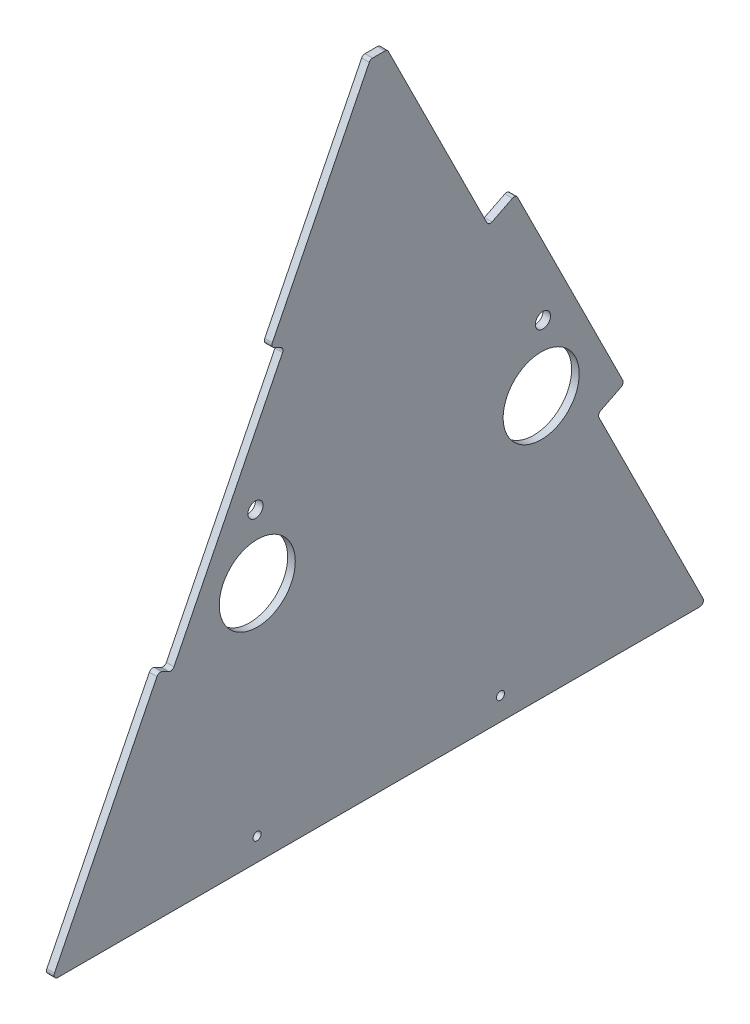
ISO-10303-21;
HEADER;
FILE_DESCRIPTION(('STEP AP214'),'2;1');
FILE_NAME('part.step','',(''),(''),'','','');
FILE_SCHEMA(('AUTOMOTIVE_DESIGN { 1 0 10303 214 1 1 1 1 }'));
ENDSEC;
DATA;
#1=APPLICATION_CONTEXT('core data for automotive mechanical design processes');
#2=APPLICATION_PROTOCOL_DEFINITION('international standard','automotive_design',2000,#1);
#3=PRODUCT_CONTEXT('',#1,'mechanical');
#4=PRODUCT('Part','Part','',(#3));
#5=PRODUCT_RELATED_PRODUCT_CATEGORY('part','',(#4));
#6=PRODUCT_DEFINITION_FORMATION('','',#4);
#7=PRODUCT_DEFINITION_CONTEXT('part definition',#1,'design');
#8=PRODUCT_DEFINITION('design','',#6,#7);
#9=PRODUCT_DEFINITION_SHAPE('','',#8);
#10=(LENGTH_UNIT() NAMED_UNIT(*) SI_UNIT(.MILLI.,.METRE.));
#11=(NAMED_UNIT(*) PLANE_ANGLE_UNIT() SI_UNIT($,.RADIAN.));
#12=(NAMED_UNIT(*) SI_UNIT($,.STERADIAN.) SOLID_ANGLE_UNIT());
#13=UNCERTAINTY_MEASURE_WITH_UNIT(LENGTH_MEASURE(1.E-05),#10,'distance_accuracy_value','');
#14=(GEOMETRIC_REPRESENTATION_CONTEXT(3) GLOBAL_UNCERTAINTY_ASSIGNED_CONTEXT((#13)) GLOBAL_UNIT_ASSIGNED_CONTEXT((#10,
#11,#12)) REPRESENTATION_CONTEXT('',''));
#15=CARTESIAN_POINT('',(0.,0.,0.));
#16=DIRECTION('',(0.,0.,1.));
#17=DIRECTION('',(1.,0.,0.));
#18=AXIS2_PLACEMENT_3D('',#15,#16,#17);
#19=CARTESIAN_POINT('',(6.35,0.,0.));
#20=DIRECTION('',(1.,0.,0.));
#21=DIRECTION('',(0.,0.,-1.));
#22=AXIS2_PLACEMENT_3D('',#19,#20,#21);
#23=PLANE('',#22);
#24=CARTESIAN_POINT('',(6.35,201.821183312528,-171.579254548243));
#25=DIRECTION('',(1.,0.,0.));
#26=DIRECTION('',(0.,0.,-1.));
#27=AXIS2_PLACEMENT_3D('',#24,#25,#26);
#28=CIRCLE('',#27,31.75);
#29=CARTESIAN_POINT('',(6.35,201.821183312528,-203.329254548243));
#30=VERTEX_POINT('',#29);
#31=EDGE_CURVE('E583',#30,#30,#28,.T.);
#32=ORIENTED_EDGE('',*,*,#31,.F.);
#33=EDGE_LOOP('',(#32));
#34=FACE_BOUND('',#33,.T.);
#35=CARTESIAN_POINT('',(6.35,272.775993416298,-410.098906564131));
#36=DIRECTION('',(1.,0.,0.));
#37=DIRECTION('',(0.,0.,-1.));
#38=AXIS2_PLACEMENT_3D('',#35,#36,#37);
#39=CIRCLE('',#38,6.34999999999973);
#40=CARTESIAN_POINT('',(6.35,272.775993416298,-416.448906564131));
#41=VERTEX_POINT('',#40);
#42=EDGE_CURVE('E571',#41,#41,#39,.T.);
#43=ORIENTED_EDGE('',*,*,#42,.F.);
#44=EDGE_LOOP('',(#43));
#45=FACE_BOUND('',#44,.T.);
#46=CARTESIAN_POINT('',(6.35,19.05,-171.45));
#47=DIRECTION('',(1.,0.,0.));
#48=DIRECTION('',(0.,0.,-1.));
#49=AXIS2_PLACEMENT_3D('',#46,#47,#48);
#50=CIRCLE('',#49,3.3734375);
#51=CARTESIAN_POINT('',(6.35,19.05,-174.8234375));
#52=VERTEX_POINT('',#51);
#53=EDGE_CURVE('E227',#52,#52,#50,.T.);
#54=ORIENTED_EDGE('',*,*,#53,.F.);
#55=EDGE_LOOP('',(#54));
#56=FACE_BOUND('',#55,.T.);
#57=DIRECTION('',(0.,0.446197813109807,0.894934361602026));
#58=VECTOR('',#57,1.);
#59=CARTESIAN_POINT('',(6.35,173.342533452951,-100.616383959635));
#60=LINE('',#59,#58);
#61=CARTESIAN_POINT('',(6.35,174.759211509574,-97.7749673615484));
#62=VERTEX_POINT('',#61);
#63=CARTESIAN_POINT('',(6.35,177.592567622822,-92.0921341653755));
#64=VERTEX_POINT('',#63);
#65=EDGE_CURVE('E236',#62,#64,#60,.T.);
#66=ORIENTED_EDGE('',*,*,#65,.T.);
#67=CARTESIAN_POINT('',(6.35,174.751151024735,-90.6754561087519));
#68=DIRECTION('',(1.,0.,0.));
#69=DIRECTION('',(0.,0.,-1.));
#70=AXIS2_PLACEMENT_3D('',#67,#68,#69);
#71=CIRCLE('',#70,3.175);
#72=CARTESIAN_POINT('',(6.35,176.167829081359,-87.8340395106655));
#73=VERTEX_POINT('',#72);
#74=EDGE_CURVE('E296',#64,#73,#71,.T.);
#75=ORIENTED_EDGE('',*,*,#74,.T.);
#76=DIRECTION('',(0.,-0.894934361602026,0.446197813109807));
#77=VECTOR('',#76,1.);
#78=CARTESIAN_POINT('',(6.35,0.,0.));
#79=LINE('',#78,#77);
#80=CARTESIAN_POINT('',(6.35,4.59167805662364,-2.28932622913505));
#81=VERTEX_POINT('',#80);
#82=EDGE_CURVE('E219',#73,#81,#79,.T.);
#83=ORIENTED_EDGE('',*,*,#82,.T.);
#84=CARTESIAN_POINT('',(6.35,3.175,-5.13074282722149));
#85=DIRECTION('',(1.,0.,0.));
#86=DIRECTION('',(0.,0.,-1.));
#87=AXIS2_PLACEMENT_3D('',#84,#85,#86);
#88=CIRCLE('',#87,3.175);
#89=CARTESIAN_POINT('',(6.35,0.,-5.13074282722149));
#90=VERTEX_POINT('',#89);
#91=EDGE_CURVE('E282',#81,#90,#88,.T.);
#92=ORIENTED_EDGE('',*,*,#91,.T.);
#93=DIRECTION('',(0.,0.,-1.));
#94=VECTOR('',#93,1.);
#95=CARTESIAN_POINT('',(6.35,0.,0.));
#96=LINE('',#95,#94);
#97=CARTESIAN_POINT('',(6.35,0.,-540.969257172778));
#98=VERTEX_POINT('',#97);
#99=EDGE_CURVE('E384',#90,#98,#96,.T.);
#100=ORIENTED_EDGE('',*,*,#99,.T.);
#101=CARTESIAN_POINT('',(6.35,3.17500000000001,-540.969257172778));
#102=DIRECTION('',(1.,0.,0.));
#103=DIRECTION('',(0.,0.,-1.));
#104=AXIS2_PLACEMENT_3D('',#101,#102,#103);
#105=CIRCLE('',#104,3.175);
#106=CARTESIAN_POINT('',(6.35,4.59167805662361,-543.810673770865));
#107=VERTEX_POINT('',#106);
#108=EDGE_CURVE('E284',#98,#107,#105,.T.);
#109=ORIENTED_EDGE('',*,*,#108,.T.);
#110=DIRECTION('',(0.,0.894934361602026,0.446197813109807));
#111=VECTOR('',#110,1.);
#112=CARTESIAN_POINT('',(6.35,181.850662277532,-455.432604376087));
#113=LINE('',#112,#111);
#114=CARTESIAN_POINT('',(6.35,179.009245679445,-456.849282432711));
#115=VERTEX_POINT('',#114);
#116=EDGE_CURVE('E375',#107,#115,#113,.T.);
#117=ORIENTED_EDGE('',*,*,#116,.T.);
#118=CARTESIAN_POINT('',(6.35,180.425923736069,-459.690699030797));
#119=DIRECTION('',(1.,0.,0.));
#120=DIRECTION('',(0.,0.,-1.));
#121=AXIS2_PLACEMENT_3D('',#118,#119,#120);
#122=CIRCLE('',#121,3.175);
#123=CARTESIAN_POINT('',(6.35,183.267340334155,-458.274020974174));
#124=VERTEX_POINT('',#123);
#125=EDGE_CURVE('E11',#115,#124,#122,.F.);
#126=ORIENTED_EDGE('',*,*,#125,.T.);
#127=DIRECTION('',(0.,0.446197813109807,-0.894934361602026));
#128=VECTOR('',#127,1.);
#129=CARTESIAN_POINT('',(6.35,193.184086730521,-478.163937160779));
#130=LINE('',#129,#128);
#131=CARTESIAN_POINT('',(6.35,191.767408673897,-475.322520562692));
#132=VERTEX_POINT('',#131);
#133=EDGE_CURVE('E373',#124,#132,#130,.T.);
#134=ORIENTED_EDGE('',*,*,#133,.T.);
#135=CARTESIAN_POINT('',(6.35,194.608825271984,-473.905842506069));
#136=DIRECTION('',(1.,0.,0.));
#137=DIRECTION('',(0.,0.,-1.));
#138=AXIS2_PLACEMENT_3D('',#135,#136,#137);
#139=CIRCLE('',#138,3.175);
#140=CARTESIAN_POINT('',(6.35,196.025503328607,-476.747259104155));
#141=VERTEX_POINT('',#140);
#142=EDGE_CURVE('E286',#132,#141,#139,.T.);
#143=ORIENTED_EDGE('',*,*,#142,.T.);
#144=DIRECTION('',(0.,0.894934361602027,0.446197813109806));
#145=VECTOR('',#144,1.);
#146=CARTESIAN_POINT('',(6.35,375.034749008053,-387.496541536866));
#147=LINE('',#146,#145);
#148=CARTESIAN_POINT('',(6.35,372.193332409966,-388.91321959349));
#149=VERTEX_POINT('',#148);
#150=EDGE_CURVE('E379',#141,#149,#147,.T.);
#151=ORIENTED_EDGE('',*,*,#150,.T.);
#152=CARTESIAN_POINT('',(6.35,370.776654353343,-386.071802995404));
#153=DIRECTION('',(1.,0.,0.));
#154=DIRECTION('',(0.,0.,-1.));
#155=AXIS2_PLACEMENT_3D('',#152,#153,#154);
#156=CIRCLE('',#155,3.175);
#157=CARTESIAN_POINT('',(6.35,373.618070951429,-384.65512493878));
#158=VERTEX_POINT('',#157);
#159=EDGE_CURVE('E288',#149,#158,#156,.T.);
#160=ORIENTED_EDGE('',*,*,#159,.T.);
#161=DIRECTION('',(0.,-0.446197813109806,0.894934361602026));
#162=VECTOR('',#161,1.);
#163=CARTESIAN_POINT('',(6.35,363.701324555063,-364.765208752175));
#164=LINE('',#163,#162);
#165=CARTESIAN_POINT('',(6.35,365.118002611687,-367.606625350261));
#166=VERTEX_POINT('',#165);
#167=EDGE_CURVE('E382',#158,#166,#164,.T.);
#168=ORIENTED_EDGE('',*,*,#167,.T.);
#169=CARTESIAN_POINT('',(6.35,367.959419209774,-366.189947293637));
#170=DIRECTION('',(1.,0.,0.));
#171=DIRECTION('',(0.,0.,-1.));
#172=AXIS2_PLACEMENT_3D('',#169,#170,#171);
#173=CIRCLE('',#172,3.175);
#174=CARTESIAN_POINT('',(6.35,366.54274115315,-363.348530695551));
#175=VERTEX_POINT('',#174);
#176=EDGE_CURVE('E356',#166,#175,#173,.F.);
#177=ORIENTED_EDGE('',*,*,#176,.T.);
#178=DIRECTION('',(0.,0.894934361602026,0.446197813109807));
#179=VECTOR('',#178,1.);
#180=CARTESIAN_POINT('',(6.35,533.4,-280.156570264301));
#181=LINE('',#180,#179);
#182=CARTESIAN_POINT('',(6.35,531.641678056624,-281.033237246305));
#183=VERTEX_POINT('',#182);
#184=EDGE_CURVE('E390',#175,#183,#181,.T.);
#185=ORIENTED_EDGE('',*,*,#184,.T.);
#186=CARTESIAN_POINT('',(6.35,530.225,-278.191820648219));
#187=DIRECTION('',(1.,0.,0.));
#188=DIRECTION('',(0.,0.,-1.));
#189=AXIS2_PLACEMENT_3D('',#186,#187,#188);
#190=CIRCLE('',#189,3.175);
#191=CARTESIAN_POINT('',(6.35,533.4,-278.191820648219));
#192=VERTEX_POINT('',#191);
#193=EDGE_CURVE('E290',#183,#192,#190,.T.);
#194=ORIENTED_EDGE('',*,*,#193,.T.);
#195=DIRECTION('',(0.,0.,1.));
#196=VECTOR('',#195,1.);
#197=CARTESIAN_POINT('',(6.35,533.4,-265.943429735699));
#198=LINE('',#197,#196);
#199=CARTESIAN_POINT('',(6.35,533.4,-267.908179351781));
#200=VERTEX_POINT('',#199);
#201=EDGE_CURVE('E393',#192,#200,#198,.T.);
#202=ORIENTED_EDGE('',*,*,#201,.T.);
#203=CARTESIAN_POINT('',(6.35,530.225,-267.908179351781));
#204=DIRECTION('',(1.,0.,0.));
#205=DIRECTION('',(0.,0.,-1.));
#206=AXIS2_PLACEMENT_3D('',#203,#204,#205);
#207=CIRCLE('',#206,3.175);
#208=CARTESIAN_POINT('',(6.35,531.641678056624,-265.066762753695));
#209=VERTEX_POINT('',#208);
#210=EDGE_CURVE('E292',#200,#209,#207,.T.);
#211=ORIENTED_EDGE('',*,*,#210,.T.);
#212=DIRECTION('',(0.,-0.894934361602026,0.446197813109807));
#213=VECTOR('',#212,1.);
#214=CARTESIAN_POINT('',(6.35,366.54274115315,-182.751469304449));
#215=LINE('',#214,#213);
#216=CARTESIAN_POINT('',(6.35,369.384157751236,-184.168147361073));
#217=VERTEX_POINT('',#216);
#218=EDGE_CURVE('E396',#209,#217,#215,.T.);
#219=ORIENTED_EDGE('',*,*,#218,.T.);
#220=CARTESIAN_POINT('',(6.35,367.967479694613,-187.009563959159));
#221=DIRECTION('',(1.,0.,0.));
#222=DIRECTION('',(0.,0.,-1.));
#223=AXIS2_PLACEMENT_3D('',#220,#221,#222);
#224=CIRCLE('',#223,3.175);
#225=CARTESIAN_POINT('',(6.35,365.126063096526,-185.592885902535));
#226=VERTEX_POINT('',#225);
#227=EDGE_CURVE('E294',#217,#226,#224,.T.);
#228=ORIENTED_EDGE('',*,*,#227,.T.);
#229=DIRECTION('',(0.,-0.446197813109804,-0.894934361602027));
#230=VECTOR('',#229,1.);
#231=CARTESIAN_POINT('',(6.35,366.54274115315,-182.751469304449));
#232=LINE('',#231,#230);
#233=CARTESIAN_POINT('',(6.35,362.292706983279,-191.275719098708));
#234=VERTEX_POINT('',#233);
#235=EDGE_CURVE('E399',#226,#234,#232,.T.);
#236=ORIENTED_EDGE('',*,*,#235,.T.);
#237=CARTESIAN_POINT('',(6.35,359.451290385192,-189.859041042085));
#238=DIRECTION('',(1.,0.,0.));
#239=DIRECTION('',(0.,0.,-1.));
#240=AXIS2_PLACEMENT_3D('',#237,#238,#239);
#241=CIRCLE('',#240,3.175);
#242=CARTESIAN_POINT('',(6.35,358.034612328569,-192.700457640171));
#243=VERTEX_POINT('',#242);
#244=EDGE_CURVE('E59',#234,#243,#241,.F.);
#245=ORIENTED_EDGE('',*,*,#244,.T.);
#246=DIRECTION('',(0.,-0.894934361602026,0.446197813109806));
#247=VECTOR('',#246,1.);
#248=CARTESIAN_POINT('',(6.35,360.876028926655,-194.117135696795));
#249=LINE('',#248,#247);
#250=CARTESIAN_POINT('',(6.35,176.183950051037,-102.033062016258));
#251=VERTEX_POINT('',#250);
#252=EDGE_CURVE('E400',#243,#251,#249,.T.);
#253=ORIENTED_EDGE('',*,*,#252,.T.);
#254=CARTESIAN_POINT('',(6.35,177.600628107661,-99.191645418172));
#255=DIRECTION('',(1.,0.,0.));
#256=DIRECTION('',(0.,0.,-1.));
#257=AXIS2_PLACEMENT_3D('',#254,#255,#256);
#258=CIRCLE('',#257,3.175);
#259=EDGE_CURVE('E349',#251,#62,#258,.F.);
#260=ORIENTED_EDGE('',*,*,#259,.T.);
#261=EDGE_LOOP('',(#66,#75,#83,#92,#100,#109,#117,#126,#134,#143,#151,#160,#168,#177,#185,#194,
#202,#211,#219,#228,#236,#245,#253,#260));
#262=FACE_BOUND('',#261,.T.);
#263=CARTESIAN_POINT('',(6.35,19.05,-374.65));
#264=DIRECTION('',(1.,0.,0.));
#265=DIRECTION('',(0.,0.,-1.));
#266=AXIS2_PLACEMENT_3D('',#263,#264,#265);
#267=CIRCLE('',#266,3.37343750000003);
#268=CARTESIAN_POINT('',(6.35,19.05,-378.0234375));
#269=VERTEX_POINT('',#268);
#270=EDGE_CURVE('E566',#269,#269,#267,.T.);
#271=ORIENTED_EDGE('',*,*,#270,.F.);
#272=EDGE_LOOP('',(#271));
#273=FACE_BOUND('',#272,.T.);
#274=CARTESIAN_POINT('',(6.35,255.775856736814,-170.098092612906));
#275=DIRECTION('',(1.,0.,0.));
#276=DIRECTION('',(0.,0.,-1.));
#277=AXIS2_PLACEMENT_3D('',#274,#275,#276);
#278=CIRCLE('',#277,6.34999999999997);
#279=CARTESIAN_POINT('',(6.35,255.775856736814,-176.448092612906));
#280=VERTEX_POINT('',#279);
#281=EDGE_CURVE('E577',#280,#280,#278,.T.);
#282=ORIENTED_EDGE('',*,*,#281,.F.);
#283=EDGE_LOOP('',(#282));
#284=FACE_BOUND('',#283,.T.);
#285=CARTESIAN_POINT('',(6.35,218.821319992012,-408.617744628794));
#286=DIRECTION('',(1.,0.,0.));
#287=DIRECTION('',(0.,0.,-1.));
#288=AXIS2_PLACEMENT_3D('',#285,#286,#287);
#289=CIRCLE('',#288,31.75);
#290=CARTESIAN_POINT('',(6.35,218.821319992012,-440.367744628794));
#291=VERTEX_POINT('',#290);
#292=EDGE_CURVE('E589',#291,#291,#289,.T.);
#293=ORIENTED_EDGE('',*,*,#292,.F.);
#294=EDGE_LOOP('',(#293));
#295=FACE_BOUND('',#294,.T.);
#296=ADVANCED_FACE('F37',(#34,#45,#56,#262,#273,#284,#295),#23,.T.);
#297=CARTESIAN_POINT('',(0.,0.,0.));
#298=DIRECTION('',(1.,0.,0.));
#299=DIRECTION('',(0.,0.,-1.));
#300=AXIS2_PLACEMENT_3D('',#297,#298,#299);
#301=PLANE('',#300);
#302=DIRECTION('',(0.,-0.894934361602026,0.446197813109807));
#303=VECTOR('',#302,1.);
#304=CARTESIAN_POINT('',(0.,0.,0.));
#305=LINE('',#304,#303);
#306=CARTESIAN_POINT('',(0.,176.167829081359,-87.8340395106655));
#307=VERTEX_POINT('',#306);
#308=CARTESIAN_POINT('',(0.,4.59167805662364,-2.28932622913505));
#309=VERTEX_POINT('',#308);
#310=EDGE_CURVE('E216',#307,#309,#305,.T.);
#311=ORIENTED_EDGE('',*,*,#310,.F.);
#312=CARTESIAN_POINT('',(0.,174.751151024735,-90.6754561087519));
#313=DIRECTION('',(1.,0.,0.));
#314=DIRECTION('',(0.,0.,-1.));
#315=AXIS2_PLACEMENT_3D('',#312,#313,#314);
#316=CIRCLE('',#315,3.175);
#317=CARTESIAN_POINT('',(0.,177.592567622822,-92.0921341653755));
#318=VERTEX_POINT('',#317);
#319=EDGE_CURVE('E199',#307,#318,#316,.F.);
#320=ORIENTED_EDGE('',*,*,#319,.T.);
#321=DIRECTION('',(0.,0.446197813109807,0.894934361602026));
#322=VECTOR('',#321,1.);
#323=CARTESIAN_POINT('',(0.,173.342533452951,-100.616383959635));
#324=LINE('',#323,#322);
#325=CARTESIAN_POINT('',(0.,174.759211509574,-97.7749673615484));
#326=VERTEX_POINT('',#325);
#327=EDGE_CURVE('E264',#326,#318,#324,.T.);
#328=ORIENTED_EDGE('',*,*,#327,.F.);
#329=CARTESIAN_POINT('',(0.,177.600628107661,-99.191645418172));
#330=DIRECTION('',(1.,0.,0.));
#331=DIRECTION('',(0.,0.,-1.));
#332=AXIS2_PLACEMENT_3D('',#329,#330,#331);
#333=CIRCLE('',#332,3.175);
#334=CARTESIAN_POINT('',(0.,176.183950051037,-102.033062016258));
#335=VERTEX_POINT('',#334);
#336=EDGE_CURVE('E347',#326,#335,#333,.T.);
#337=ORIENTED_EDGE('',*,*,#336,.T.);
#338=DIRECTION('',(0.,-0.894934361602026,0.446197813109806));
#339=VECTOR('',#338,1.);
#340=CARTESIAN_POINT('',(0.,360.876028926655,-194.117135696795));
#341=LINE('',#340,#339);
#342=CARTESIAN_POINT('',(0.,358.034612328569,-192.700457640171));
#343=VERTEX_POINT('',#342);
#344=EDGE_CURVE('E262',#343,#335,#341,.T.);
#345=ORIENTED_EDGE('',*,*,#344,.F.);
#346=CARTESIAN_POINT('',(0.,359.451290385192,-189.859041042085));
#347=DIRECTION('',(1.,0.,0.));
#348=DIRECTION('',(0.,0.,-1.));
#349=AXIS2_PLACEMENT_3D('',#346,#347,#348);
#350=CIRCLE('',#349,3.175);
#351=CARTESIAN_POINT('',(0.,362.292706983279,-191.275719098708));
#352=VERTEX_POINT('',#351);
#353=EDGE_CURVE('E351',#343,#352,#350,.T.);
#354=ORIENTED_EDGE('',*,*,#353,.T.);
#355=DIRECTION('',(0.,-0.446197813109804,-0.894934361602027));
#356=VECTOR('',#355,1.);
#357=CARTESIAN_POINT('',(0.,366.54274115315,-182.751469304449));
#358=LINE('',#357,#356);
#359=CARTESIAN_POINT('',(0.,365.126063096526,-185.592885902535));
#360=VERTEX_POINT('',#359);
#361=EDGE_CURVE('E259',#360,#352,#358,.T.);
#362=ORIENTED_EDGE('',*,*,#361,.F.);
#363=CARTESIAN_POINT('',(0.,367.967479694613,-187.009563959159));
#364=DIRECTION('',(1.,0.,0.));
#365=DIRECTION('',(0.,0.,-1.));
#366=AXIS2_PLACEMENT_3D('',#363,#364,#365);
#367=CIRCLE('',#366,3.175);
#368=CARTESIAN_POINT('',(0.,369.384157751236,-184.168147361073));
#369=VERTEX_POINT('',#368);
#370=EDGE_CURVE('E210',#360,#369,#367,.F.);
#371=ORIENTED_EDGE('',*,*,#370,.T.);
#372=DIRECTION('',(0.,-0.894934361602026,0.446197813109807));
#373=VECTOR('',#372,1.);
#374=CARTESIAN_POINT('',(0.,366.54274115315,-182.751469304449));
#375=LINE('',#374,#373);
#376=CARTESIAN_POINT('',(0.,531.641678056624,-265.066762753695));
#377=VERTEX_POINT('',#376);
#378=EDGE_CURVE('E256',#377,#369,#375,.T.);
#379=ORIENTED_EDGE('',*,*,#378,.F.);
#380=CARTESIAN_POINT('',(0.,530.225,-267.908179351781));
#381=DIRECTION('',(1.,0.,0.));
#382=DIRECTION('',(0.,0.,-1.));
#383=AXIS2_PLACEMENT_3D('',#380,#381,#382);
#384=CIRCLE('',#383,3.175);
#385=CARTESIAN_POINT('',(0.,533.4,-267.908179351781));
#386=VERTEX_POINT('',#385);
#387=EDGE_CURVE('E276',#377,#386,#384,.F.);
#388=ORIENTED_EDGE('',*,*,#387,.T.);
#389=DIRECTION('',(0.,0.,1.));
#390=VECTOR('',#389,1.);
#391=CARTESIAN_POINT('',(0.,533.4,-265.943429735699));
#392=LINE('',#391,#390);
#393=CARTESIAN_POINT('',(0.,533.4,-278.191820648219));
#394=VERTEX_POINT('',#393);
#395=EDGE_CURVE('E253',#394,#386,#392,.T.);
#396=ORIENTED_EDGE('',*,*,#395,.F.);
#397=CARTESIAN_POINT('',(0.,530.225,-278.191820648219));
#398=DIRECTION('',(1.,0.,0.));
#399=DIRECTION('',(0.,0.,-1.));
#400=AXIS2_PLACEMENT_3D('',#397,#398,#399);
#401=CIRCLE('',#400,3.175);
#402=CARTESIAN_POINT('',(0.,531.641678056624,-281.033237246305));
#403=VERTEX_POINT('',#402);
#404=EDGE_CURVE('E274',#394,#403,#401,.F.);
#405=ORIENTED_EDGE('',*,*,#404,.T.);
#406=DIRECTION('',(0.,0.894934361602026,0.446197813109807));
#407=VECTOR('',#406,1.);
#408=CARTESIAN_POINT('',(0.,533.4,-280.156570264301));
#409=LINE('',#408,#407);
#410=CARTESIAN_POINT('',(0.,366.54274115315,-363.348530695551));
#411=VERTEX_POINT('',#410);
#412=EDGE_CURVE('E250',#411,#403,#409,.T.);
#413=ORIENTED_EDGE('',*,*,#412,.F.);
#414=CARTESIAN_POINT('',(0.,367.959419209774,-366.189947293637));
#415=DIRECTION('',(1.,0.,0.));
#416=DIRECTION('',(0.,0.,-1.));
#417=AXIS2_PLACEMENT_3D('',#414,#415,#416);
#418=CIRCLE('',#417,3.175);
#419=CARTESIAN_POINT('',(0.,365.118002611687,-367.606625350261));
#420=VERTEX_POINT('',#419);
#421=EDGE_CURVE('E354',#411,#420,#418,.T.);
#422=ORIENTED_EDGE('',*,*,#421,.T.);
#423=DIRECTION('',(0.,-0.446197813109806,0.894934361602026));
#424=VECTOR('',#423,1.);
#425=CARTESIAN_POINT('',(0.,363.701324555063,-364.765208752175));
#426=LINE('',#425,#424);
#427=CARTESIAN_POINT('',(0.,373.618070951429,-384.65512493878));
#428=VERTEX_POINT('',#427);
#429=EDGE_CURVE('E247',#428,#420,#426,.T.);
#430=ORIENTED_EDGE('',*,*,#429,.F.);
#431=CARTESIAN_POINT('',(0.,370.776654353343,-386.071802995404));
#432=DIRECTION('',(1.,0.,0.));
#433=DIRECTION('',(0.,0.,-1.));
#434=AXIS2_PLACEMENT_3D('',#431,#432,#433);
#435=CIRCLE('',#434,3.175);
#436=CARTESIAN_POINT('',(0.,372.193332409966,-388.91321959349));
#437=VERTEX_POINT('',#436);
#438=EDGE_CURVE('E272',#428,#437,#435,.F.);
#439=ORIENTED_EDGE('',*,*,#438,.T.);
#440=DIRECTION('',(0.,0.894934361602027,0.446197813109806));
#441=VECTOR('',#440,1.);
#442=CARTESIAN_POINT('',(0.,375.034749008053,-387.496541536866));
#443=LINE('',#442,#441);
#444=CARTESIAN_POINT('',(0.,196.025503328607,-476.747259104155));
#445=VERTEX_POINT('',#444);
#446=EDGE_CURVE('E244',#445,#437,#443,.T.);
#447=ORIENTED_EDGE('',*,*,#446,.F.);
#448=CARTESIAN_POINT('',(0.,194.608825271984,-473.905842506069));
#449=DIRECTION('',(1.,0.,0.));
#450=DIRECTION('',(0.,0.,-1.));
#451=AXIS2_PLACEMENT_3D('',#448,#449,#450);
#452=CIRCLE('',#451,3.175);
#453=CARTESIAN_POINT('',(0.,191.767408673897,-475.322520562692));
#454=VERTEX_POINT('',#453);
#455=EDGE_CURVE('E270',#445,#454,#452,.F.);
#456=ORIENTED_EDGE('',*,*,#455,.T.);
#457=DIRECTION('',(0.,0.446197813109807,-0.894934361602026));
#458=VECTOR('',#457,1.);
#459=CARTESIAN_POINT('',(0.,193.184086730521,-478.163937160779));
#460=LINE('',#459,#458);
#461=CARTESIAN_POINT('',(0.,183.267340334155,-458.274020974174));
#462=VERTEX_POINT('',#461);
#463=EDGE_CURVE('E241',#462,#454,#460,.T.);
#464=ORIENTED_EDGE('',*,*,#463,.F.);
#465=CARTESIAN_POINT('',(0.,180.425923736069,-459.690699030797));
#466=DIRECTION('',(1.,0.,0.));
#467=DIRECTION('',(0.,0.,-1.));
#468=AXIS2_PLACEMENT_3D('',#465,#466,#467);
#469=CIRCLE('',#468,3.175);
#470=CARTESIAN_POINT('',(0.,179.009245679445,-456.849282432711));
#471=VERTEX_POINT('',#470);
#472=EDGE_CURVE('E45',#462,#471,#469,.T.);
#473=ORIENTED_EDGE('',*,*,#472,.T.);
#474=DIRECTION('',(0.,0.894934361602026,0.446197813109807));
#475=VECTOR('',#474,1.);
#476=CARTESIAN_POINT('',(0.,181.850662277532,-455.432604376087));
#477=LINE('',#476,#475);
#478=CARTESIAN_POINT('',(0.,4.59167805662361,-543.810673770865));
#479=VERTEX_POINT('',#478);
#480=EDGE_CURVE('E230',#479,#471,#477,.T.);
#481=ORIENTED_EDGE('',*,*,#480,.F.);
#482=CARTESIAN_POINT('',(0.,3.17500000000001,-540.969257172778));
#483=DIRECTION('',(1.,0.,0.));
#484=DIRECTION('',(0.,0.,-1.));
#485=AXIS2_PLACEMENT_3D('',#482,#483,#484);
#486=CIRCLE('',#485,3.175);
#487=CARTESIAN_POINT('',(0.,0.,-540.969257172778));
#488=VERTEX_POINT('',#487);
#489=EDGE_CURVE('E268',#479,#488,#486,.F.);
#490=ORIENTED_EDGE('',*,*,#489,.T.);
#491=DIRECTION('',(0.,0.,-1.));
#492=VECTOR('',#491,1.);
#493=CARTESIAN_POINT('',(0.,0.,0.));
#494=LINE('',#493,#492);
#495=CARTESIAN_POINT('',(0.,0.,-5.13074282722149));
#496=VERTEX_POINT('',#495);
#497=EDGE_CURVE('E226',#496,#488,#494,.T.);
#498=ORIENTED_EDGE('',*,*,#497,.F.);
#499=CARTESIAN_POINT('',(0.,3.175,-5.13074282722149));
#500=DIRECTION('',(1.,0.,0.));
#501=DIRECTION('',(0.,0.,-1.));
#502=AXIS2_PLACEMENT_3D('',#499,#500,#501);
#503=CIRCLE('',#502,3.175);
#504=EDGE_CURVE('E220',#496,#309,#503,.F.);
#505=ORIENTED_EDGE('',*,*,#504,.T.);
#506=EDGE_LOOP('',(#311,#320,#328,#337,#345,#354,#362,#371,#379,#388,#396,#405,#413,#422,#430,
#439,#447,#456,#464,#473,#481,#490,#498,#505));
#507=FACE_BOUND('',#506,.T.);
#508=CARTESIAN_POINT('',(0.,19.05,-171.45));
#509=DIRECTION('',(1.,0.,0.));
#510=DIRECTION('',(0.,0.,-1.));
#511=AXIS2_PLACEMENT_3D('',#508,#509,#510);
#512=CIRCLE('',#511,3.3734375);
#513=CARTESIAN_POINT('',(0.,19.05,-174.8234375));
#514=VERTEX_POINT('',#513);
#515=EDGE_CURVE('E233',#514,#514,#512,.T.);
#516=ORIENTED_EDGE('',*,*,#515,.T.);
#517=EDGE_LOOP('',(#516));
#518=FACE_BOUND('',#517,.T.);
#519=CARTESIAN_POINT('',(0.,19.05,-374.65));
#520=DIRECTION('',(1.,0.,0.));
#521=DIRECTION('',(0.,0.,-1.));
#522=AXIS2_PLACEMENT_3D('',#519,#520,#521);
#523=CIRCLE('',#522,3.37343750000003);
#524=CARTESIAN_POINT('',(0.,19.05,-378.0234375));
#525=VERTEX_POINT('',#524);
#526=EDGE_CURVE('E568',#525,#525,#523,.T.);
#527=ORIENTED_EDGE('',*,*,#526,.T.);
#528=EDGE_LOOP('',(#527));
#529=FACE_BOUND('',#528,.T.);
#530=CARTESIAN_POINT('',(0.,272.775993416298,-410.098906564131));
#531=DIRECTION('',(1.,0.,0.));
#532=DIRECTION('',(0.,0.,-1.));
#533=AXIS2_PLACEMENT_3D('',#530,#531,#532);
#534=CIRCLE('',#533,6.34999999999973);
#535=CARTESIAN_POINT('',(0.,272.775993416298,-416.448906564131));
#536=VERTEX_POINT('',#535);
#537=EDGE_CURVE('E574',#536,#536,#534,.T.);
#538=ORIENTED_EDGE('',*,*,#537,.T.);
#539=EDGE_LOOP('',(#538));
#540=FACE_BOUND('',#539,.T.);
#541=CARTESIAN_POINT('',(0.,255.775856736814,-170.098092612906));
#542=DIRECTION('',(1.,0.,0.));
#543=DIRECTION('',(0.,0.,-1.));
#544=AXIS2_PLACEMENT_3D('',#541,#542,#543);
#545=CIRCLE('',#544,6.34999999999997);
#546=CARTESIAN_POINT('',(0.,255.775856736814,-176.448092612906));
#547=VERTEX_POINT('',#546);
#548=EDGE_CURVE('E580',#547,#547,#545,.T.);
#549=ORIENTED_EDGE('',*,*,#548,.T.);
#550=EDGE_LOOP('',(#549));
#551=FACE_BOUND('',#550,.T.);
#552=CARTESIAN_POINT('',(0.,201.821183312528,-171.579254548243));
#553=DIRECTION('',(1.,0.,0.));
#554=DIRECTION('',(0.,0.,-1.));
#555=AXIS2_PLACEMENT_3D('',#552,#553,#554);
#556=CIRCLE('',#555,31.75);
#557=CARTESIAN_POINT('',(0.,201.821183312528,-203.329254548243));
#558=VERTEX_POINT('',#557);
#559=EDGE_CURVE('E586',#558,#558,#556,.T.);
#560=ORIENTED_EDGE('',*,*,#559,.T.);
#561=EDGE_LOOP('',(#560));
#562=FACE_BOUND('',#561,.T.);
#563=CARTESIAN_POINT('',(0.,218.821319992012,-408.617744628794));
#564=DIRECTION('',(1.,0.,0.));
#565=DIRECTION('',(0.,0.,-1.));
#566=AXIS2_PLACEMENT_3D('',#563,#564,#565);
#567=CIRCLE('',#566,31.75);
#568=CARTESIAN_POINT('',(0.,218.821319992012,-440.367744628794));
#569=VERTEX_POINT('',#568);
#570=EDGE_CURVE('E592',#569,#569,#567,.T.);
#571=ORIENTED_EDGE('',*,*,#570,.T.);
#572=EDGE_LOOP('',(#571));
#573=FACE_BOUND('',#572,.T.);
#574=ADVANCED_FACE('F223',(#507,#518,#529,#540,#551,#562,#573),#301,.F.);
#575=CARTESIAN_POINT('',(6.35,0.,0.));
#576=DIRECTION('',(0.,-0.446197813109807,-0.894934361602026));
#577=DIRECTION('',(0.,0.894934361602026,-0.446197813109807));
#578=AXIS2_PLACEMENT_3D('',#575,#576,#577);
#579=PLANE('',#578);
#580=ORIENTED_EDGE('',*,*,#82,.F.);
#581=DIRECTION('',(-1.,0.,0.));
#582=VECTOR('',#581,1.);
#583=CARTESIAN_POINT('',(6.35,176.167829081359,-87.8340395106655));
#584=LINE('',#583,#582);
#585=EDGE_CURVE('E203',#73,#307,#584,.T.);
#586=ORIENTED_EDGE('',*,*,#585,.T.);
#587=ORIENTED_EDGE('',*,*,#310,.T.);
#588=DIRECTION('',(-1.,0.,0.));
#589=VECTOR('',#588,1.);
#590=CARTESIAN_POINT('',(6.35,4.59167805662364,-2.28932622913506));
#591=LINE('',#590,#589);
#592=EDGE_CURVE('E221',#309,#81,#591,.F.);
#593=ORIENTED_EDGE('',*,*,#592,.T.);
#594=EDGE_LOOP('',(#580,#586,#587,#593));
#595=FACE_BOUND('',#594,.T.);
#596=ADVANCED_FACE('F215',(#595),#579,.F.);
#597=CARTESIAN_POINT('',(6.35,0.,0.));
#598=DIRECTION('',(0.,1.,0.));
#599=DIRECTION('',(0.,0.,1.));
#600=AXIS2_PLACEMENT_3D('',#597,#598,#599);
#601=PLANE('',#600);
#602=ORIENTED_EDGE('',*,*,#497,.T.);
#603=DIRECTION('',(-1.,0.,0.));
#604=VECTOR('',#603,1.);
#605=CARTESIAN_POINT('',(6.35,0.,-540.969257172778));
#606=LINE('',#605,#604);
#607=EDGE_CURVE('E345',#488,#98,#606,.F.);
#608=ORIENTED_EDGE('',*,*,#607,.T.);
#609=ORIENTED_EDGE('',*,*,#99,.F.);
#610=DIRECTION('',(-1.,0.,0.));
#611=VECTOR('',#610,1.);
#612=CARTESIAN_POINT('',(6.35,0.,-5.13074282722149));
#613=LINE('',#612,#611);
#614=EDGE_CURVE('E342',#90,#496,#613,.T.);
#615=ORIENTED_EDGE('',*,*,#614,.T.);
#616=EDGE_LOOP('',(#602,#608,#609,#615));
#617=FACE_BOUND('',#616,.T.);
#618=ADVANCED_FACE('F509',(#617),#601,.F.);
#619=CARTESIAN_POINT('',(6.35,181.850662277532,-455.432604376087));
#620=DIRECTION('',(0.,-0.446197813109807,0.894934361602026));
#621=DIRECTION('',(0.,-0.894934361602026,-0.446197813109807));
#622=AXIS2_PLACEMENT_3D('',#619,#620,#621);
#623=PLANE('',#622);
#624=ORIENTED_EDGE('',*,*,#480,.T.);
#625=DIRECTION('',(-1.,0.,0.));
#626=VECTOR('',#625,1.);
#627=CARTESIAN_POINT('',(6.35,179.009245679445,-456.849282432711));
#628=LINE('',#627,#626);
#629=EDGE_CURVE('E340',#471,#115,#628,.F.);
#630=ORIENTED_EDGE('',*,*,#629,.T.);
#631=ORIENTED_EDGE('',*,*,#116,.F.);
#632=DIRECTION('',(-1.,0.,0.));
#633=VECTOR('',#632,1.);
#634=CARTESIAN_POINT('',(6.35,4.59167805662367,-543.810673770865));
#635=LINE('',#634,#633);
#636=EDGE_CURVE('E337',#107,#479,#635,.T.);
#637=ORIENTED_EDGE('',*,*,#636,.T.);
#638=EDGE_LOOP('',(#624,#630,#631,#637));
#639=FACE_BOUND('',#638,.T.);
#640=ADVANCED_FACE('F363',(#639),#623,.F.);
#641=CARTESIAN_POINT('',(6.35,193.184086730521,-478.163937160779));
#642=DIRECTION('',(0.,0.894934361602026,0.446197813109807));
#643=DIRECTION('',(0.,-0.446197813109807,0.894934361602026));
#644=AXIS2_PLACEMENT_3D('',#641,#642,#643);
#645=PLANE('',#644);
#646=ORIENTED_EDGE('',*,*,#463,.T.);
#647=DIRECTION('',(-1.,0.,0.));
#648=VECTOR('',#647,1.);
#649=CARTESIAN_POINT('',(6.35,191.767408673897,-475.322520562692));
#650=LINE('',#649,#648);
#651=EDGE_CURVE('E335',#454,#132,#650,.F.);
#652=ORIENTED_EDGE('',*,*,#651,.T.);
#653=ORIENTED_EDGE('',*,*,#133,.F.);
#654=DIRECTION('',(-1.,0.,0.));
#655=VECTOR('',#654,1.);
#656=CARTESIAN_POINT('',(0.,183.267340334155,-458.274020974174));
#657=LINE('',#656,#655);
#658=EDGE_CURVE('E332',#124,#462,#657,.T.);
#659=ORIENTED_EDGE('',*,*,#658,.T.);
#660=EDGE_LOOP('',(#646,#652,#653,#659));
#661=FACE_BOUND('',#660,.T.);
#662=ADVANCED_FACE('F377',(#661),#645,.F.);
#663=CARTESIAN_POINT('',(6.35,375.034749008053,-387.496541536866));
#664=DIRECTION('',(0.,-0.446197813109806,0.894934361602027));
#665=DIRECTION('',(0.,-0.894934361602027,-0.446197813109806));
#666=AXIS2_PLACEMENT_3D('',#663,#664,#665);
#667=PLANE('',#666);
#668=ORIENTED_EDGE('',*,*,#446,.T.);
#669=DIRECTION('',(-1.,0.,0.));
#670=VECTOR('',#669,1.);
#671=CARTESIAN_POINT('',(6.35,372.193332409966,-388.91321959349));
#672=LINE('',#671,#670);
#673=EDGE_CURVE('E330',#437,#149,#672,.F.);
#674=ORIENTED_EDGE('',*,*,#673,.T.);
#675=ORIENTED_EDGE('',*,*,#150,.F.);
#676=DIRECTION('',(-1.,0.,0.));
#677=VECTOR('',#676,1.);
#678=CARTESIAN_POINT('',(6.35,196.025503328607,-476.747259104155));
#679=LINE('',#678,#677);
#680=EDGE_CURVE('E327',#141,#445,#679,.T.);
#681=ORIENTED_EDGE('',*,*,#680,.T.);
#682=EDGE_LOOP('',(#668,#674,#675,#681));
#683=FACE_BOUND('',#682,.T.);
#684=ADVANCED_FACE('F461',(#683),#667,.F.);
#685=CARTESIAN_POINT('',(6.35,363.701324555063,-364.765208752175));
#686=DIRECTION('',(0.,-0.894934361602026,-0.446197813109806));
#687=DIRECTION('',(0.,0.446197813109806,-0.894934361602026));
#688=AXIS2_PLACEMENT_3D('',#685,#686,#687);
#689=PLANE('',#688);
#690=ORIENTED_EDGE('',*,*,#429,.T.);
#691=DIRECTION('',(-1.,0.,0.));
#692=VECTOR('',#691,1.);
#693=CARTESIAN_POINT('',(6.35,365.118002611687,-367.606625350261));
#694=LINE('',#693,#692);
#695=EDGE_CURVE('E325',#420,#166,#694,.F.);
#696=ORIENTED_EDGE('',*,*,#695,.T.);
#697=ORIENTED_EDGE('',*,*,#167,.F.);
#698=DIRECTION('',(-1.,0.,0.));
#699=VECTOR('',#698,1.);
#700=CARTESIAN_POINT('',(6.35,373.618070951429,-384.65512493878));
#701=LINE('',#700,#699);
#702=EDGE_CURVE('E322',#158,#428,#701,.T.);
#703=ORIENTED_EDGE('',*,*,#702,.T.);
#704=EDGE_LOOP('',(#690,#696,#697,#703));
#705=FACE_BOUND('',#704,.T.);
#706=ADVANCED_FACE('F452',(#705),#689,.F.);
#707=CARTESIAN_POINT('',(6.35,533.4,-280.156570264301));
#708=DIRECTION('',(0.,-0.446197813109807,0.894934361602026));
#709=DIRECTION('',(0.,-0.894934361602026,-0.446197813109807));
#710=AXIS2_PLACEMENT_3D('',#707,#708,#709);
#711=PLANE('',#710);
#712=ORIENTED_EDGE('',*,*,#412,.T.);
#713=DIRECTION('',(-1.,0.,0.));
#714=VECTOR('',#713,1.);
#715=CARTESIAN_POINT('',(6.35,531.641678056624,-281.033237246305));
#716=LINE('',#715,#714);
#717=EDGE_CURVE('E320',#403,#183,#716,.F.);
#718=ORIENTED_EDGE('',*,*,#717,.T.);
#719=ORIENTED_EDGE('',*,*,#184,.F.);
#720=DIRECTION('',(-1.,0.,0.));
#721=VECTOR('',#720,1.);
#722=CARTESIAN_POINT('',(0.,366.54274115315,-363.348530695551));
#723=LINE('',#722,#721);
#724=EDGE_CURVE('E317',#175,#411,#723,.T.);
#725=ORIENTED_EDGE('',*,*,#724,.T.);
#726=EDGE_LOOP('',(#712,#718,#719,#725));
#727=FACE_BOUND('',#726,.T.);
#728=ADVANCED_FACE('F443',(#727),#711,.F.);
#729=CARTESIAN_POINT('',(6.35,533.4,-265.943429735699));
#730=DIRECTION('',(0.,-1.,0.));
#731=DIRECTION('',(0.,0.,-1.));
#732=AXIS2_PLACEMENT_3D('',#729,#730,#731);
#733=PLANE('',#732);
#734=ORIENTED_EDGE('',*,*,#395,.T.);
#735=DIRECTION('',(-1.,0.,0.));
#736=VECTOR('',#735,1.);
#737=CARTESIAN_POINT('',(6.35,533.4,-267.908179351781));
#738=LINE('',#737,#736);
#739=EDGE_CURVE('E315',#386,#200,#738,.F.);
#740=ORIENTED_EDGE('',*,*,#739,.T.);
#741=ORIENTED_EDGE('',*,*,#201,.F.);
#742=DIRECTION('',(-1.,0.,0.));
#743=VECTOR('',#742,1.);
#744=CARTESIAN_POINT('',(6.35,533.4,-278.191820648219));
#745=LINE('',#744,#743);
#746=EDGE_CURVE('E312',#192,#394,#745,.T.);
#747=ORIENTED_EDGE('',*,*,#746,.T.);
#748=EDGE_LOOP('',(#734,#740,#741,#747));
#749=FACE_BOUND('',#748,.T.);
#750=ADVANCED_FACE('F434',(#749),#733,.F.);
#751=CARTESIAN_POINT('',(6.35,366.54274115315,-182.751469304449));
#752=DIRECTION('',(0.,-0.446197813109807,-0.894934361602026));
#753=DIRECTION('',(0.,0.894934361602026,-0.446197813109807));
#754=AXIS2_PLACEMENT_3D('',#751,#752,#753);
#755=PLANE('',#754);
#756=ORIENTED_EDGE('',*,*,#378,.T.);
#757=DIRECTION('',(-1.,0.,0.));
#758=VECTOR('',#757,1.);
#759=CARTESIAN_POINT('',(6.35,369.384157751236,-184.168147361073));
#760=LINE('',#759,#758);
#761=EDGE_CURVE('E310',#369,#217,#760,.F.);
#762=ORIENTED_EDGE('',*,*,#761,.T.);
#763=ORIENTED_EDGE('',*,*,#218,.F.);
#764=DIRECTION('',(-1.,0.,0.));
#765=VECTOR('',#764,1.);
#766=CARTESIAN_POINT('',(6.35,531.641678056624,-265.066762753695));
#767=LINE('',#766,#765);
#768=EDGE_CURVE('E307',#209,#377,#767,.T.);
#769=ORIENTED_EDGE('',*,*,#768,.T.);
#770=EDGE_LOOP('',(#756,#762,#763,#769));
#771=FACE_BOUND('',#770,.T.);
#772=ADVANCED_FACE('F425',(#771),#755,.F.);
#773=CARTESIAN_POINT('',(6.35,366.54274115315,-182.751469304449));
#774=DIRECTION('',(0.,0.894934361602027,-0.446197813109804));
#775=DIRECTION('',(0.,0.446197813109804,0.894934361602027));
#776=AXIS2_PLACEMENT_3D('',#773,#774,#775);
#777=PLANE('',#776);
#778=ORIENTED_EDGE('',*,*,#361,.T.);
#779=DIRECTION('',(-1.,0.,0.));
#780=VECTOR('',#779,1.);
#781=CARTESIAN_POINT('',(6.35,362.292706983279,-191.275719098708));
#782=LINE('',#781,#780);
#783=EDGE_CURVE('E305',#352,#234,#782,.F.);
#784=ORIENTED_EDGE('',*,*,#783,.T.);
#785=ORIENTED_EDGE('',*,*,#235,.F.);
#786=DIRECTION('',(-1.,0.,0.));
#787=VECTOR('',#786,1.);
#788=CARTESIAN_POINT('',(6.35,365.126063096526,-185.592885902535));
#789=LINE('',#788,#787);
#790=EDGE_CURVE('E302',#226,#360,#789,.T.);
#791=ORIENTED_EDGE('',*,*,#790,.T.);
#792=EDGE_LOOP('',(#778,#784,#785,#791));
#793=FACE_BOUND('',#792,.T.);
#794=ADVANCED_FACE('F416',(#793),#777,.F.);
#795=CARTESIAN_POINT('',(6.35,360.876028926655,-194.117135696795));
#796=DIRECTION('',(0.,-0.446197813109807,-0.894934361602026));
#797=DIRECTION('',(0.,0.894934361602026,-0.446197813109807));
#798=AXIS2_PLACEMENT_3D('',#795,#796,#797);
#799=PLANE('',#798);
#800=ORIENTED_EDGE('',*,*,#344,.T.);
#801=DIRECTION('',(-1.,0.,0.));
#802=VECTOR('',#801,1.);
#803=CARTESIAN_POINT('',(6.35,176.183950051037,-102.033062016258));
#804=LINE('',#803,#802);
#805=EDGE_CURVE('E52',#335,#251,#804,.F.);
#806=ORIENTED_EDGE('',*,*,#805,.T.);
#807=ORIENTED_EDGE('',*,*,#252,.F.);
#808=DIRECTION('',(-1.,0.,0.));
#809=VECTOR('',#808,1.);
#810=CARTESIAN_POINT('',(0.,358.034612328569,-192.700457640171));
#811=LINE('',#810,#809);
#812=EDGE_CURVE('E298',#243,#343,#811,.T.);
#813=ORIENTED_EDGE('',*,*,#812,.T.);
#814=EDGE_LOOP('',(#800,#806,#807,#813));
#815=FACE_BOUND('',#814,.T.);
#816=ADVANCED_FACE('F409',(#815),#799,.F.);
#817=CARTESIAN_POINT('',(6.35,173.342533452951,-100.616383959635));
#818=DIRECTION('',(0.,-0.894934361602026,0.446197813109807));
#819=DIRECTION('',(0.,-0.446197813109807,-0.894934361602026));
#820=AXIS2_PLACEMENT_3D('',#817,#818,#819);
#821=PLANE('',#820);
#822=ORIENTED_EDGE('',*,*,#327,.T.);
#823=DIRECTION('',(-1.,0.,0.));
#824=VECTOR('',#823,1.);
#825=CARTESIAN_POINT('',(6.35,177.592567622822,-92.0921341653755));
#826=LINE('',#825,#824);
#827=EDGE_CURVE('E204',#318,#64,#826,.F.);
#828=ORIENTED_EDGE('',*,*,#827,.T.);
#829=ORIENTED_EDGE('',*,*,#65,.F.);
#830=DIRECTION('',(-1.,0.,0.));
#831=VECTOR('',#830,1.);
#832=CARTESIAN_POINT('',(0.,174.759211509574,-97.7749673615484));
#833=LINE('',#832,#831);
#834=EDGE_CURVE('E209',#62,#326,#833,.T.);
#835=ORIENTED_EDGE('',*,*,#834,.T.);
#836=EDGE_LOOP('',(#822,#828,#829,#835));
#837=FACE_BOUND('',#836,.T.);
#838=ADVANCED_FACE('F405',(#837),#821,.F.);
#839=CARTESIAN_POINT('',(6.35,19.05,-171.45));
#840=DIRECTION('',(-1.,0.,0.));
#841=DIRECTION('',(0.,0.,1.));
#842=AXIS2_PLACEMENT_3D('',#839,#840,#841);
#843=CYLINDRICAL_SURFACE('',#842,3.3734375);
#844=ORIENTED_EDGE('',*,*,#53,.T.);
#845=EDGE_LOOP('',(#844));
#846=FACE_BOUND('',#845,.T.);
#847=ORIENTED_EDGE('',*,*,#515,.F.);
#848=EDGE_LOOP('',(#847));
#849=FACE_BOUND('',#848,.T.);
#850=ADVANCED_FACE('F486',(#846,#849),#843,.F.);
#851=CARTESIAN_POINT('',(6.35,19.05,-374.65));
#852=DIRECTION('',(-1.,0.,0.));
#853=DIRECTION('',(0.,0.,1.));
#854=AXIS2_PLACEMENT_3D('',#851,#852,#853);
#855=CYLINDRICAL_SURFACE('',#854,3.37343750000003);
#856=ORIENTED_EDGE('',*,*,#270,.T.);
#857=EDGE_LOOP('',(#856));
#858=FACE_BOUND('',#857,.T.);
#859=ORIENTED_EDGE('',*,*,#526,.F.);
#860=EDGE_LOOP('',(#859));
#861=FACE_BOUND('',#860,.T.);
#862=ADVANCED_FACE('F616',(#858,#861),#855,.F.);
#863=CARTESIAN_POINT('',(6.35,272.775993416298,-410.098906564131));
#864=DIRECTION('',(-1.,0.,0.));
#865=DIRECTION('',(0.,0.,1.));
#866=AXIS2_PLACEMENT_3D('',#863,#864,#865);
#867=CYLINDRICAL_SURFACE('',#866,6.34999999999973);
#868=ORIENTED_EDGE('',*,*,#42,.T.);
#869=EDGE_LOOP('',(#868));
#870=FACE_BOUND('',#869,.T.);
#871=ORIENTED_EDGE('',*,*,#537,.F.);
#872=EDGE_LOOP('',(#871));
#873=FACE_BOUND('',#872,.T.);
#874=ADVANCED_FACE('F613',(#870,#873),#867,.F.);
#875=CARTESIAN_POINT('',(6.35,255.775856736814,-170.098092612906));
#876=DIRECTION('',(-1.,0.,0.));
#877=DIRECTION('',(0.,0.,1.));
#878=AXIS2_PLACEMENT_3D('',#875,#876,#877);
#879=CYLINDRICAL_SURFACE('',#878,6.34999999999997);
#880=ORIENTED_EDGE('',*,*,#281,.T.);
#881=EDGE_LOOP('',(#880));
#882=FACE_BOUND('',#881,.T.);
#883=ORIENTED_EDGE('',*,*,#548,.F.);
#884=EDGE_LOOP('',(#883));
#885=FACE_BOUND('',#884,.T.);
#886=ADVANCED_FACE('F607',(#882,#885),#879,.F.);
#887=CARTESIAN_POINT('',(6.35,201.821183312528,-171.579254548243));
#888=DIRECTION('',(-1.,0.,0.));
#889=DIRECTION('',(0.,0.,1.));
#890=AXIS2_PLACEMENT_3D('',#887,#888,#889);
#891=CYLINDRICAL_SURFACE('',#890,31.75);
#892=ORIENTED_EDGE('',*,*,#31,.T.);
#893=EDGE_LOOP('',(#892));
#894=FACE_BOUND('',#893,.T.);
#895=ORIENTED_EDGE('',*,*,#559,.F.);
#896=EDGE_LOOP('',(#895));
#897=FACE_BOUND('',#896,.T.);
#898=ADVANCED_FACE('F600',(#894,#897),#891,.F.);
#899=CARTESIAN_POINT('',(6.35,218.821319992012,-408.617744628794));
#900=DIRECTION('',(-1.,0.,0.));
#901=DIRECTION('',(0.,0.,1.));
#902=AXIS2_PLACEMENT_3D('',#899,#900,#901);
#903=CYLINDRICAL_SURFACE('',#902,31.75);
#904=ORIENTED_EDGE('',*,*,#292,.T.);
#905=EDGE_LOOP('',(#904));
#906=FACE_BOUND('',#905,.T.);
#907=ORIENTED_EDGE('',*,*,#570,.F.);
#908=EDGE_LOOP('',(#907));
#909=FACE_BOUND('',#908,.T.);
#910=ADVANCED_FACE('F517',(#906,#909),#903,.F.);
#911=CARTESIAN_POINT('',(6.35,174.751151024735,-90.6754561087519));
#912=DIRECTION('',(-1.,0.,0.));
#913=DIRECTION('',(0.,0.,1.));
#914=AXIS2_PLACEMENT_3D('',#911,#912,#913);
#915=CYLINDRICAL_SURFACE('',#914,3.175);
#916=ORIENTED_EDGE('',*,*,#74,.F.);
#917=ORIENTED_EDGE('',*,*,#827,.F.);
#918=ORIENTED_EDGE('',*,*,#319,.F.);
#919=ORIENTED_EDGE('',*,*,#585,.F.);
#920=EDGE_LOOP('',(#916,#917,#918,#919));
#921=FACE_BOUND('',#920,.T.);
#922=ADVANCED_FACE('F202',(#921),#915,.T.);
#923=CARTESIAN_POINT('',(6.35,177.600628107661,-99.191645418172));
#924=DIRECTION('',(1.,0.,0.));
#925=DIRECTION('',(0.,0.,-1.));
#926=AXIS2_PLACEMENT_3D('',#923,#924,#925);
#927=CYLINDRICAL_SURFACE('',#926,3.175);
#928=ORIENTED_EDGE('',*,*,#259,.F.);
#929=ORIENTED_EDGE('',*,*,#805,.F.);
#930=ORIENTED_EDGE('',*,*,#336,.F.);
#931=ORIENTED_EDGE('',*,*,#834,.F.);
#932=EDGE_LOOP('',(#928,#929,#930,#931));
#933=FACE_BOUND('',#932,.T.);
#934=ADVANCED_FACE('F407',(#933),#927,.F.);
#935=CARTESIAN_POINT('',(6.35,359.451290385192,-189.859041042085));
#936=DIRECTION('',(1.,0.,0.));
#937=DIRECTION('',(0.,0.,-1.));
#938=AXIS2_PLACEMENT_3D('',#935,#936,#937);
#939=CYLINDRICAL_SURFACE('',#938,3.175);
#940=ORIENTED_EDGE('',*,*,#244,.F.);
#941=ORIENTED_EDGE('',*,*,#783,.F.);
#942=ORIENTED_EDGE('',*,*,#353,.F.);
#943=ORIENTED_EDGE('',*,*,#812,.F.);
#944=EDGE_LOOP('',(#940,#941,#942,#943));
#945=FACE_BOUND('',#944,.T.);
#946=ADVANCED_FACE('F412',(#945),#939,.F.);
#947=CARTESIAN_POINT('',(6.35,367.967479694613,-187.009563959159));
#948=DIRECTION('',(-1.,0.,0.));
#949=DIRECTION('',(0.,0.,1.));
#950=AXIS2_PLACEMENT_3D('',#947,#948,#949);
#951=CYLINDRICAL_SURFACE('',#950,3.175);
#952=ORIENTED_EDGE('',*,*,#227,.F.);
#953=ORIENTED_EDGE('',*,*,#761,.F.);
#954=ORIENTED_EDGE('',*,*,#370,.F.);
#955=ORIENTED_EDGE('',*,*,#790,.F.);
#956=EDGE_LOOP('',(#952,#953,#954,#955));
#957=FACE_BOUND('',#956,.T.);
#958=ADVANCED_FACE('F421',(#957),#951,.T.);
#959=CARTESIAN_POINT('',(6.35,530.225,-267.908179351781));
#960=DIRECTION('',(-1.,0.,0.));
#961=DIRECTION('',(0.,0.,1.));
#962=AXIS2_PLACEMENT_3D('',#959,#960,#961);
#963=CYLINDRICAL_SURFACE('',#962,3.175);
#964=ORIENTED_EDGE('',*,*,#210,.F.);
#965=ORIENTED_EDGE('',*,*,#739,.F.);
#966=ORIENTED_EDGE('',*,*,#387,.F.);
#967=ORIENTED_EDGE('',*,*,#768,.F.);
#968=EDGE_LOOP('',(#964,#965,#966,#967));
#969=FACE_BOUND('',#968,.T.);
#970=ADVANCED_FACE('F430',(#969),#963,.T.);
#971=CARTESIAN_POINT('',(6.35,530.225,-278.191820648219));
#972=DIRECTION('',(-1.,0.,0.));
#973=DIRECTION('',(0.,0.,1.));
#974=AXIS2_PLACEMENT_3D('',#971,#972,#973);
#975=CYLINDRICAL_SURFACE('',#974,3.175);
#976=ORIENTED_EDGE('',*,*,#193,.F.);
#977=ORIENTED_EDGE('',*,*,#717,.F.);
#978=ORIENTED_EDGE('',*,*,#404,.F.);
#979=ORIENTED_EDGE('',*,*,#746,.F.);
#980=EDGE_LOOP('',(#976,#977,#978,#979));
#981=FACE_BOUND('',#980,.T.);
#982=ADVANCED_FACE('F439',(#981),#975,.T.);
#983=CARTESIAN_POINT('',(6.35,367.959419209774,-366.189947293637));
#984=DIRECTION('',(1.,0.,0.));
#985=DIRECTION('',(0.,0.,-1.));
#986=AXIS2_PLACEMENT_3D('',#983,#984,#985);
#987=CYLINDRICAL_SURFACE('',#986,3.175);
#988=ORIENTED_EDGE('',*,*,#176,.F.);
#989=ORIENTED_EDGE('',*,*,#695,.F.);
#990=ORIENTED_EDGE('',*,*,#421,.F.);
#991=ORIENTED_EDGE('',*,*,#724,.F.);
#992=EDGE_LOOP('',(#988,#989,#990,#991));
#993=FACE_BOUND('',#992,.T.);
#994=ADVANCED_FACE('F448',(#993),#987,.F.);
#995=CARTESIAN_POINT('',(6.35,370.776654353343,-386.071802995404));
#996=DIRECTION('',(-1.,0.,0.));
#997=DIRECTION('',(0.,0.,1.));
#998=AXIS2_PLACEMENT_3D('',#995,#996,#997);
#999=CYLINDRICAL_SURFACE('',#998,3.175);
#1000=ORIENTED_EDGE('',*,*,#159,.F.);
#1001=ORIENTED_EDGE('',*,*,#673,.F.);
#1002=ORIENTED_EDGE('',*,*,#438,.F.);
#1003=ORIENTED_EDGE('',*,*,#702,.F.);
#1004=EDGE_LOOP('',(#1000,#1001,#1002,#1003));
#1005=FACE_BOUND('',#1004,.T.);
#1006=ADVANCED_FACE('F457',(#1005),#999,.T.);
#1007=CARTESIAN_POINT('',(6.35,194.608825271984,-473.905842506069));
#1008=DIRECTION('',(-1.,0.,0.));
#1009=DIRECTION('',(0.,0.,1.));
#1010=AXIS2_PLACEMENT_3D('',#1007,#1008,#1009);
#1011=CYLINDRICAL_SURFACE('',#1010,3.175);
#1012=ORIENTED_EDGE('',*,*,#142,.F.);
#1013=ORIENTED_EDGE('',*,*,#651,.F.);
#1014=ORIENTED_EDGE('',*,*,#455,.F.);
#1015=ORIENTED_EDGE('',*,*,#680,.F.);
#1016=EDGE_LOOP('',(#1012,#1013,#1014,#1015));
#1017=FACE_BOUND('',#1016,.T.);
#1018=ADVANCED_FACE('F465',(#1017),#1011,.T.);
#1019=CARTESIAN_POINT('',(6.35,180.425923736069,-459.690699030797));
#1020=DIRECTION('',(1.,0.,0.));
#1021=DIRECTION('',(0.,0.,-1.));
#1022=AXIS2_PLACEMENT_3D('',#1019,#1020,#1021);
#1023=CYLINDRICAL_SURFACE('',#1022,3.175);
#1024=ORIENTED_EDGE('',*,*,#125,.F.);
#1025=ORIENTED_EDGE('',*,*,#629,.F.);
#1026=ORIENTED_EDGE('',*,*,#472,.F.);
#1027=ORIENTED_EDGE('',*,*,#658,.F.);
#1028=EDGE_LOOP('',(#1024,#1025,#1026,#1027));
#1029=FACE_BOUND('',#1028,.T.);
#1030=ADVANCED_FACE('F368',(#1029),#1023,.F.);
#1031=CARTESIAN_POINT('',(6.35,3.17500000000001,-540.969257172778));
#1032=DIRECTION('',(-1.,0.,0.));
#1033=DIRECTION('',(0.,0.,1.));
#1034=AXIS2_PLACEMENT_3D('',#1031,#1032,#1033);
#1035=CYLINDRICAL_SURFACE('',#1034,3.175);
#1036=ORIENTED_EDGE('',*,*,#108,.F.);
#1037=ORIENTED_EDGE('',*,*,#607,.F.);
#1038=ORIENTED_EDGE('',*,*,#489,.F.);
#1039=ORIENTED_EDGE('',*,*,#636,.F.);
#1040=EDGE_LOOP('',(#1036,#1037,#1038,#1039));
#1041=FACE_BOUND('',#1040,.T.);
#1042=ADVANCED_FACE('F472',(#1041),#1035,.T.);
#1043=CARTESIAN_POINT('',(6.35,3.175,-5.13074282722149));
#1044=DIRECTION('',(-1.,0.,0.));
#1045=DIRECTION('',(0.,0.,1.));
#1046=AXIS2_PLACEMENT_3D('',#1043,#1044,#1045);
#1047=CYLINDRICAL_SURFACE('',#1046,3.175);
#1048=ORIENTED_EDGE('',*,*,#91,.F.);
#1049=ORIENTED_EDGE('',*,*,#592,.F.);
#1050=ORIENTED_EDGE('',*,*,#504,.F.);
#1051=ORIENTED_EDGE('',*,*,#614,.F.);
#1052=EDGE_LOOP('',(#1048,#1049,#1050,#1051));
#1053=FACE_BOUND('',#1052,.T.);
#1054=ADVANCED_FACE('F39',(#1053),#1047,.T.);
#1055=CLOSED_SHELL('',(#296,#574,#596,#618,#640,#662,#684,#706,#728,#750,#772,#794,#816,#838,
#850,#862,#874,#886,#898,#910,#922,#934,#946,#958,#970,#982,#994,#1006,#1018,#1030,#1042,#1054));
#1056=MANIFOLD_SOLID_BREP('B2',#1055);
#1057=ADVANCED_BREP_SHAPE_REPRESENTATION('',(#18,#1056),#14);
#1058=SHAPE_DEFINITION_REPRESENTATION(#9,#1057);
ENDSEC;
END-ISO-10303-21;
